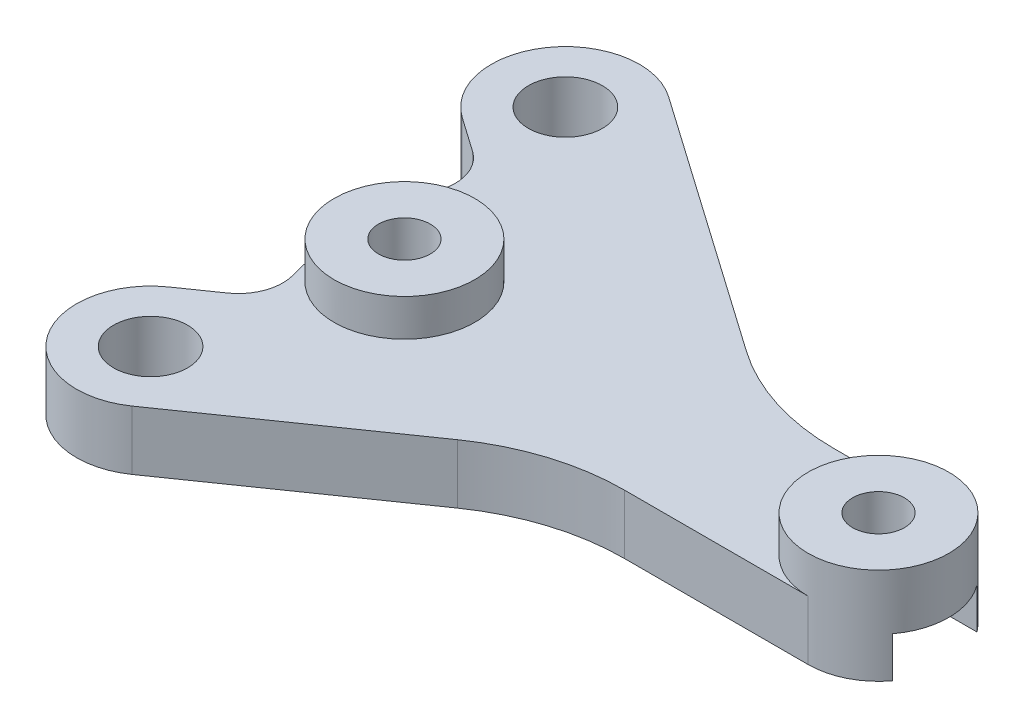
ISO-10303-21;
HEADER;
FILE_DESCRIPTION(('STEP AP214'),'2;1');
FILE_NAME('part.step','',(''),(''),'','','');
FILE_SCHEMA(('AUTOMOTIVE_DESIGN { 1 0 10303 214 1 1 1 1 }'));
ENDSEC;
DATA;
#1=APPLICATION_CONTEXT('core data for automotive mechanical design processes');
#2=APPLICATION_PROTOCOL_DEFINITION('international standard','automotive_design',2000,#1);
#3=PRODUCT_CONTEXT('',#1,'mechanical');
#4=PRODUCT('Part','Part','',(#3));
#5=PRODUCT_RELATED_PRODUCT_CATEGORY('part','',(#4));
#6=PRODUCT_DEFINITION_FORMATION('','',#4);
#7=PRODUCT_DEFINITION_CONTEXT('part definition',#1,'design');
#8=PRODUCT_DEFINITION('design','',#6,#7);
#9=PRODUCT_DEFINITION_SHAPE('','',#8);
#10=(LENGTH_UNIT() NAMED_UNIT(*) SI_UNIT(.MILLI.,.METRE.));
#11=(NAMED_UNIT(*) PLANE_ANGLE_UNIT() SI_UNIT($,.RADIAN.));
#12=(NAMED_UNIT(*) SI_UNIT($,.STERADIAN.) SOLID_ANGLE_UNIT());
#13=UNCERTAINTY_MEASURE_WITH_UNIT(LENGTH_MEASURE(1.E-05),#10,'distance_accuracy_value','');
#14=(GEOMETRIC_REPRESENTATION_CONTEXT(3) GLOBAL_UNCERTAINTY_ASSIGNED_CONTEXT((#13)) GLOBAL_UNIT_ASSIGNED_CONTEXT((#10,
#11,#12)) REPRESENTATION_CONTEXT('',''));
#15=CARTESIAN_POINT('',(0.,0.,0.));
#16=DIRECTION('',(0.,0.,1.));
#17=DIRECTION('',(1.,0.,0.));
#18=AXIS2_PLACEMENT_3D('',#15,#16,#17);
#19=CARTESIAN_POINT('',(0.,0.,0.));
#20=DIRECTION('',(0.,1.,0.));
#21=DIRECTION('',(0.,0.,1.));
#22=AXIS2_PLACEMENT_3D('',#19,#20,#21);
#23=PLANE('',#22);
#24=CARTESIAN_POINT('',(5.90778746838002,0.,-0.233987523106802));
#25=DIRECTION('',(0.,-1.,0.));
#26=DIRECTION('',(0.,0.,-1.));
#27=AXIS2_PLACEMENT_3D('',#24,#25,#26);
#28=CIRCLE('',#27,9.);
#29=CARTESIAN_POINT('',(-2.6290444966993,0.,2.6160124768932));
#30=VERTEX_POINT('',#29);
#31=CARTESIAN_POINT('',(-2.6290444966993,0.,-3.0839875231068));
#32=VERTEX_POINT('',#31);
#33=EDGE_CURVE('E542',#30,#32,#28,.T.);
#34=ORIENTED_EDGE('',*,*,#33,.F.);
#35=DIRECTION('',(-1.,0.,0.));
#36=VECTOR('',#35,1.);
#37=CARTESIAN_POINT('',(0.,0.,2.6160124768932));
#38=LINE('',#37,#36);
#39=CARTESIAN_POINT('',(9.70778746838002,0.,2.6160124768932));
#40=VERTEX_POINT('',#39);
#41=EDGE_CURVE('E519',#40,#30,#38,.T.);
#42=ORIENTED_EDGE('',*,*,#41,.F.);
#43=CARTESIAN_POINT('',(5.90778746838002,0.,-0.233987523106802));
#44=DIRECTION('',(0.,1.,0.));
#45=DIRECTION('',(0.,0.,1.));
#46=AXIS2_PLACEMENT_3D('',#43,#44,#45);
#47=CIRCLE('',#46,4.75);
#48=CARTESIAN_POINT('',(5.90778746838002,0.,4.5160124768932));
#49=VERTEX_POINT('',#48);
#50=EDGE_CURVE('E638',#49,#40,#47,.T.);
#51=ORIENTED_EDGE('',*,*,#50,.F.);
#52=DIRECTION('',(-1.,0.,0.));
#53=VECTOR('',#52,1.);
#54=CARTESIAN_POINT('',(0.,0.,4.5160124768932));
#55=LINE('',#54,#53);
#56=CARTESIAN_POINT('',(-6.50128457022286,0.,4.5160124768932));
#57=VERTEX_POINT('',#56);
#58=EDGE_CURVE('E634',#49,#57,#55,.T.);
#59=ORIENTED_EDGE('',*,*,#58,.T.);
#60=CARTESIAN_POINT('',(-6.50128457022285,0.,19.5160124768932));
#61=DIRECTION('',(0.,1.,0.));
#62=DIRECTION('',(0.,0.,1.));
#63=AXIS2_PLACEMENT_3D('',#60,#61,#62);
#64=CIRCLE('',#63,15.);
#65=CARTESIAN_POINT('',(-15.0719802077242,0.,7.20572505988642));
#66=VERTEX_POINT('',#65);
#67=EDGE_CURVE('E368',#57,#66,#64,.T.);
#68=ORIENTED_EDGE('',*,*,#67,.T.);
#69=DIRECTION('',(0.820685827800452,0.,-0.571379709166757));
#70=VECTOR('',#69,1.);
#71=CARTESIAN_POINT('',(-1.54168943588688,0.,-2.21436402203912));
#72=LINE('',#71,#70);
#73=CARTESIAN_POINT('',(-28.0195598346601,0.,16.2201176947387));
#74=VERTEX_POINT('',#73);
#75=EDGE_CURVE('E599',#74,#66,#72,.T.);
#76=ORIENTED_EDGE('',*,*,#75,.F.);
#77=CARTESIAN_POINT('',(-30.8764583804938,0.,12.1166885557364));
#78=DIRECTION('',(0.,1.,0.));
#79=DIRECTION('',(0.,0.,1.));
#80=AXIS2_PLACEMENT_3D('',#77,#78,#79);
#81=CIRCLE('',#80,5.);
#82=CARTESIAN_POINT('',(-33.7333569263276,0.,8.01325941673418));
#83=VERTEX_POINT('',#82);
#84=EDGE_CURVE('E660',#83,#74,#81,.T.);
#85=ORIENTED_EDGE('',*,*,#84,.F.);
#86=DIRECTION('',(0.820685827800452,0.,-0.571379709166756));
#87=VECTOR('',#86,1.);
#88=CARTESIAN_POINT('',(-7.25548652755441,0.,-10.4212223000436));
#89=LINE('',#88,#87);
#90=CARTESIAN_POINT('',(-31.4165898033694,0.,6.40027466656397));
#91=VERTEX_POINT('',#90);
#92=EDGE_CURVE('E657',#83,#91,#89,.T.);
#93=ORIENTED_EDGE('',*,*,#92,.T.);
#94=CARTESIAN_POINT('',(-33.1307289308697,0.,3.93821718316261));
#95=DIRECTION('',(0.,1.,0.));
#96=DIRECTION('',(0.,0.,1.));
#97=AXIS2_PLACEMENT_3D('',#94,#95,#96);
#98=CIRCLE('',#97,3.);
#99=CARTESIAN_POINT('',(-30.2453797509483,0.,3.11677935232746));
#100=VERTEX_POINT('',#99);
#101=EDGE_CURVE('E692',#91,#100,#98,.T.);
#102=ORIENTED_EDGE('',*,*,#101,.T.);
#103=CARTESIAN_POINT('',(-12.6822637877984,0.,-1.88331144426357));
#104=DIRECTION('',(0.,1.,0.));
#105=DIRECTION('',(0.,0.,1.));
#106=AXIS2_PLACEMENT_3D('',#103,#104,#105);
#107=CIRCLE('',#106,18.2609953263563);
#108=CARTESIAN_POINT('',(-30.3802872526295,0.,2.61601247689319));
#109=VERTEX_POINT('',#108);
#110=EDGE_CURVE('E653',#109,#100,#107,.T.);
#111=ORIENTED_EDGE('',*,*,#110,.F.);
#112=DIRECTION('',(-1.,0.,0.));
#113=VECTOR('',#112,1.);
#114=CARTESIAN_POINT('',(0.,0.,2.6160124768932));
#115=LINE('',#114,#113);
#116=CARTESIAN_POINT('',(-17.5553805665407,0.,2.6160124768932));
#117=VERTEX_POINT('',#116);
#118=EDGE_CURVE('E558',#117,#109,#115,.T.);
#119=ORIENTED_EDGE('',*,*,#118,.F.);
#120=CARTESIAN_POINT('',(-26.09221253162,0.,-0.233987523106804));
#121=DIRECTION('',(0.,-1.,0.));
#122=DIRECTION('',(0.,0.,-1.));
#123=AXIS2_PLACEMENT_3D('',#120,#121,#122);
#124=CIRCLE('',#123,9.);
#125=CARTESIAN_POINT('',(-17.5553805665407,0.,-3.08398752310681));
#126=VERTEX_POINT('',#125);
#127=EDGE_CURVE('E569',#126,#117,#124,.T.);
#128=ORIENTED_EDGE('',*,*,#127,.F.);
#129=DIRECTION('',(-1.,0.,0.));
#130=VECTOR('',#129,1.);
#131=CARTESIAN_POINT('',(0.,0.,-3.0839875231068));
#132=LINE('',#131,#130);
#133=CARTESIAN_POINT('',(-30.9037436196589,0.,-3.08398752310681));
#134=VERTEX_POINT('',#133);
#135=EDGE_CURVE('E566',#126,#134,#132,.T.);
#136=ORIENTED_EDGE('',*,*,#135,.T.);
#137=CARTESIAN_POINT('',(-30.2471696464017,0.,-6.8771108482854));
#138=VERTEX_POINT('',#137);
#139=EDGE_CURVE('E654',#138,#134,#107,.T.);
#140=ORIENTED_EDGE('',*,*,#139,.F.);
#141=CARTESIAN_POINT('',(-33.132812878551,0.,-7.69751510031665));
#142=DIRECTION('',(0.,1.,0.));
#143=DIRECTION('',(0.,0.,1.));
#144=AXIS2_PLACEMENT_3D('',#141,#142,#143);
#145=CIRCLE('',#144,3.);
#146=CARTESIAN_POINT('',(-31.4124258454611,0.,-10.1552108618738));
#147=VERTEX_POINT('',#146);
#148=EDGE_CURVE('E697',#138,#147,#145,.T.);
#149=ORIENTED_EDGE('',*,*,#148,.T.);
#150=DIRECTION('',(0.819231920519041,0.,0.573462344363328));
#151=VECTOR('',#150,1.);
#152=CARTESIAN_POINT('',(-5.55935641675453,0.,7.94193773822077));
#153=LINE('',#152,#151);
#154=CARTESIAN_POINT('',(-33.7437701023105,0.,-11.7871518416684));
#155=VERTEX_POINT('',#154);
#156=EDGE_CURVE('E650',#155,#147,#153,.T.);
#157=ORIENTED_EDGE('',*,*,#156,.F.);
#158=CARTESIAN_POINT('',(-30.8764583804938,0.,-15.8833114442636));
#159=DIRECTION('',(0.,1.,0.));
#160=DIRECTION('',(0.,0.,1.));
#161=AXIS2_PLACEMENT_3D('',#158,#159,#160);
#162=CIRCLE('',#161,4.99999999999999);
#163=CARTESIAN_POINT('',(-28.0091466586772,0.,-19.9794710468588));
#164=VERTEX_POINT('',#163);
#165=EDGE_CURVE('E647',#164,#155,#162,.T.);
#166=ORIENTED_EDGE('',*,*,#165,.F.);
#167=DIRECTION('',(0.81923192051904,0.,0.573462344363328));
#168=VECTOR('',#167,1.);
#169=CARTESIAN_POINT('',(0.175267026878727,0.,-0.250381466969609));
#170=LINE('',#169,#168);
#171=CARTESIAN_POINT('',(-10.460629042195,0.,-7.6955087153212));
#172=VERTEX_POINT('',#171);
#173=EDGE_CURVE('E644',#164,#172,#170,.T.);
#174=ORIENTED_EDGE('',*,*,#173,.T.);
#175=CARTESIAN_POINT('',(-1.85869387674504,0.,-19.9839875231068));
#176=DIRECTION('',(0.,1.,0.));
#177=DIRECTION('',(0.,0.,1.));
#178=AXIS2_PLACEMENT_3D('',#175,#176,#177);
#179=CIRCLE('',#178,15.);
#180=CARTESIAN_POINT('',(-1.85869387674504,0.,-4.9839875231068));
#181=VERTEX_POINT('',#180);
#182=EDGE_CURVE('E711',#172,#181,#179,.T.);
#183=ORIENTED_EDGE('',*,*,#182,.T.);
#184=DIRECTION('',(1.,0.,0.));
#185=VECTOR('',#184,1.);
#186=CARTESIAN_POINT('',(0.,0.,-4.9839875231068));
#187=LINE('',#186,#185);
#188=CARTESIAN_POINT('',(5.90778746838002,0.,-4.9839875231068));
#189=VERTEX_POINT('',#188);
#190=EDGE_CURVE('E641',#181,#189,#187,.T.);
#191=ORIENTED_EDGE('',*,*,#190,.T.);
#192=CARTESIAN_POINT('',(9.70778746838002,0.,-3.0839875231068));
#193=VERTEX_POINT('',#192);
#194=EDGE_CURVE('E637',#193,#189,#47,.T.);
#195=ORIENTED_EDGE('',*,*,#194,.F.);
#196=DIRECTION('',(-1.,0.,0.));
#197=VECTOR('',#196,1.);
#198=CARTESIAN_POINT('',(0.,0.,-3.0839875231068));
#199=LINE('',#198,#197);
#200=EDGE_CURVE('E536',#193,#32,#199,.T.);
#201=ORIENTED_EDGE('',*,*,#200,.T.);
#202=EDGE_LOOP('',(#34,#42,#51,#59,#68,#76,#85,#93,#102,#111,#119,#128,#136,#140,#149,#157,#166,
#174,#183,#191,#195,#201));
#203=FACE_BOUND('',#202,.T.);
#204=CARTESIAN_POINT('',(-30.8764583804938,0.,12.1166885557364));
#205=DIRECTION('',(0.,1.,0.));
#206=DIRECTION('',(0.,0.,1.));
#207=AXIS2_PLACEMENT_3D('',#204,#205,#206);
#208=CIRCLE('',#207,2.5);
#209=CARTESIAN_POINT('',(-30.8764583804938,0.,14.6166885557364));
#210=VERTEX_POINT('',#209);
#211=EDGE_CURVE('E631',#210,#210,#208,.T.);
#212=ORIENTED_EDGE('',*,*,#211,.T.);
#213=EDGE_LOOP('',(#212));
#214=FACE_BOUND('',#213,.T.);
#215=CARTESIAN_POINT('',(-30.8764583804938,0.,-15.8833114442636));
#216=DIRECTION('',(0.,1.,0.));
#217=DIRECTION('',(0.,0.,1.));
#218=AXIS2_PLACEMENT_3D('',#215,#216,#217);
#219=CIRCLE('',#218,2.5);
#220=CARTESIAN_POINT('',(-30.8764583804938,0.,-13.3833114442636));
#221=VERTEX_POINT('',#220);
#222=EDGE_CURVE('E592',#221,#221,#219,.T.);
#223=ORIENTED_EDGE('',*,*,#222,.T.);
#224=EDGE_LOOP('',(#223));
#225=FACE_BOUND('',#224,.T.);
#226=ADVANCED_FACE('F360',(#203,#214,#225),#23,.F.);
#227=CARTESIAN_POINT('',(5.90778746838002,4.,-0.233987523106802));
#228=DIRECTION('',(0.,-1.,0.));
#229=DIRECTION('',(0.,0.,-1.));
#230=AXIS2_PLACEMENT_3D('',#227,#228,#229);
#231=CYLINDRICAL_SURFACE('',#230,1.75);
#232=CARTESIAN_POINT('',(5.90778746838002,6.5,-0.233987523106802));
#233=DIRECTION('',(0.,1.,0.));
#234=DIRECTION('',(0.,0.,1.));
#235=AXIS2_PLACEMENT_3D('',#232,#233,#234);
#236=CIRCLE('',#235,1.75);
#237=CARTESIAN_POINT('',(5.90778746838002,6.5,1.5160124768932));
#238=VERTEX_POINT('',#237);
#239=EDGE_CURVE('E549',#238,#238,#236,.T.);
#240=ORIENTED_EDGE('',*,*,#239,.T.);
#241=EDGE_LOOP('',(#240));
#242=FACE_BOUND('',#241,.T.);
#243=CARTESIAN_POINT('',(5.90778746838002,2.75,-0.233987523106802));
#244=DIRECTION('',(0.,-1.,0.));
#245=DIRECTION('',(0.,0.,-1.));
#246=AXIS2_PLACEMENT_3D('',#243,#244,#245);
#247=CIRCLE('',#246,1.75);
#248=CARTESIAN_POINT('',(5.90778746838002,2.75,-1.9839875231068));
#249=VERTEX_POINT('',#248);
#250=EDGE_CURVE('E533',#249,#249,#247,.F.);
#251=ORIENTED_EDGE('',*,*,#250,.F.);
#252=EDGE_LOOP('',(#251));
#253=FACE_BOUND('',#252,.T.);
#254=ADVANCED_FACE('F807',(#242,#253),#231,.F.);
#255=CARTESIAN_POINT('',(-26.09221253162,4.,-0.233987523106804));
#256=DIRECTION('',(0.,-1.,0.));
#257=DIRECTION('',(0.,0.,-1.));
#258=AXIS2_PLACEMENT_3D('',#255,#256,#257);
#259=CYLINDRICAL_SURFACE('',#258,1.75);
#260=CARTESIAN_POINT('',(-26.09221253162,6.5,-0.233987523106804));
#261=DIRECTION('',(0.,1.,0.));
#262=DIRECTION('',(0.,0.,1.));
#263=AXIS2_PLACEMENT_3D('',#260,#261,#262);
#264=CIRCLE('',#263,1.75);
#265=CARTESIAN_POINT('',(-26.09221253162,6.5,1.5160124768932));
#266=VERTEX_POINT('',#265);
#267=EDGE_CURVE('E585',#266,#266,#264,.T.);
#268=ORIENTED_EDGE('',*,*,#267,.T.);
#269=EDGE_LOOP('',(#268));
#270=FACE_BOUND('',#269,.T.);
#271=CARTESIAN_POINT('',(-26.09221253162,2.75,-0.233987523106804));
#272=DIRECTION('',(0.,-1.,0.));
#273=DIRECTION('',(0.,0.,-1.));
#274=AXIS2_PLACEMENT_3D('',#271,#272,#273);
#275=CIRCLE('',#274,1.75);
#276=CARTESIAN_POINT('',(-26.09221253162,2.75,-1.9839875231068));
#277=VERTEX_POINT('',#276);
#278=EDGE_CURVE('E554',#277,#277,#275,.F.);
#279=ORIENTED_EDGE('',*,*,#278,.F.);
#280=EDGE_LOOP('',(#279));
#281=FACE_BOUND('',#280,.T.);
#282=ADVANCED_FACE('F812',(#270,#281),#259,.F.);
#283=CARTESIAN_POINT('',(-12.6822637877984,4.,-1.88331144426357));
#284=DIRECTION('',(0.,-1.,0.));
#285=DIRECTION('',(0.,0.,-1.));
#286=AXIS2_PLACEMENT_3D('',#283,#284,#285);
#287=CYLINDRICAL_SURFACE('',#286,18.2609953263563);
#288=DIRECTION('',(0.,-1.,0.));
#289=VECTOR('',#288,1.);
#290=CARTESIAN_POINT('',(-30.9037436196589,2.75,-3.08398752310681));
#291=LINE('',#290,#289);
#292=CARTESIAN_POINT('',(-30.9037436196589,2.75,-3.08398752310681));
#293=VERTEX_POINT('',#292);
#294=EDGE_CURVE('E543',#293,#134,#291,.T.);
#295=ORIENTED_EDGE('',*,*,#294,.F.);
#296=CARTESIAN_POINT('',(-12.6822637877984,2.75,-1.88331144426357));
#297=DIRECTION('',(0.,-1.,0.));
#298=DIRECTION('',(0.,0.,-1.));
#299=AXIS2_PLACEMENT_3D('',#296,#297,#298);
#300=CIRCLE('',#299,18.2609953263563);
#301=CARTESIAN_POINT('',(-30.3802872526295,2.75,2.61601247689319));
#302=VERTEX_POINT('',#301);
#303=EDGE_CURVE('E563',#302,#293,#300,.T.);
#304=ORIENTED_EDGE('',*,*,#303,.F.);
#305=DIRECTION('',(0.,-1.,0.));
#306=VECTOR('',#305,1.);
#307=CARTESIAN_POINT('',(-30.3802872526295,2.75,2.61601247689319));
#308=LINE('',#307,#306);
#309=EDGE_CURVE('E574',#302,#109,#308,.T.);
#310=ORIENTED_EDGE('',*,*,#309,.T.);
#311=ORIENTED_EDGE('',*,*,#110,.T.);
#312=DIRECTION('',(0.,-1.,0.));
#313=VECTOR('',#312,1.);
#314=CARTESIAN_POINT('',(-30.2453797509484,4.,3.11677935232746));
#315=LINE('',#314,#313);
#316=CARTESIAN_POINT('',(-30.2453797509483,4.,3.11677935232746));
#317=VERTEX_POINT('',#316);
#318=EDGE_CURVE('E688',#100,#317,#315,.F.);
#319=ORIENTED_EDGE('',*,*,#318,.T.);
#320=CARTESIAN_POINT('',(-12.6822637877984,4.,-1.88331144426357));
#321=DIRECTION('',(0.,1.,0.));
#322=DIRECTION('',(0.,0.,1.));
#323=AXIS2_PLACEMENT_3D('',#320,#321,#322);
#324=CIRCLE('',#323,18.2609953263563);
#325=CARTESIAN_POINT('',(-30.8066880380171,4.,0.345857886965393));
#326=VERTEX_POINT('',#325);
#327=EDGE_CURVE('E616',#326,#317,#324,.T.);
#328=ORIENTED_EDGE('',*,*,#327,.F.);
#329=CARTESIAN_POINT('',(-30.2471696464017,4.,-6.8771108482854));
#330=VERTEX_POINT('',#329);
#331=EDGE_CURVE('E617',#330,#326,#324,.T.);
#332=ORIENTED_EDGE('',*,*,#331,.F.);
#333=DIRECTION('',(0.,-1.,0.));
#334=VECTOR('',#333,1.);
#335=CARTESIAN_POINT('',(-30.2471696464017,4.,-6.8771108482854));
#336=LINE('',#335,#334);
#337=EDGE_CURVE('E685',#330,#138,#336,.T.);
#338=ORIENTED_EDGE('',*,*,#337,.T.);
#339=ORIENTED_EDGE('',*,*,#139,.T.);
#340=EDGE_LOOP('',(#295,#304,#310,#311,#319,#328,#332,#338,#339));
#341=FACE_BOUND('',#340,.T.);
#342=ADVANCED_FACE('F767',(#341),#287,.T.);
#343=CARTESIAN_POINT('',(0.,4.,0.));
#344=DIRECTION('',(0.,1.,0.));
#345=DIRECTION('',(0.,0.,1.));
#346=AXIS2_PLACEMENT_3D('',#343,#344,#345);
#347=PLANE('',#346);
#348=CARTESIAN_POINT('',(-30.8764583804938,4.,12.1166885557364));
#349=DIRECTION('',(0.,1.,0.));
#350=DIRECTION('',(0.,0.,1.));
#351=AXIS2_PLACEMENT_3D('',#348,#349,#350);
#352=CIRCLE('',#351,2.5);
#353=CARTESIAN_POINT('',(-30.8764583804938,4.,14.6166885557364));
#354=VERTEX_POINT('',#353);
#355=EDGE_CURVE('E598',#354,#354,#352,.T.);
#356=ORIENTED_EDGE('',*,*,#355,.F.);
#357=EDGE_LOOP('',(#356));
#358=FACE_BOUND('',#357,.T.);
#359=CARTESIAN_POINT('',(-30.8764583804938,4.,-15.8833114442636));
#360=DIRECTION('',(0.,1.,0.));
#361=DIRECTION('',(0.,0.,1.));
#362=AXIS2_PLACEMENT_3D('',#359,#360,#361);
#363=CIRCLE('',#362,2.5);
#364=CARTESIAN_POINT('',(-30.8764583804938,4.,-13.3833114442636));
#365=VERTEX_POINT('',#364);
#366=EDGE_CURVE('E595',#365,#365,#363,.T.);
#367=ORIENTED_EDGE('',*,*,#366,.F.);
#368=EDGE_LOOP('',(#367));
#369=FACE_BOUND('',#368,.T.);
#370=DIRECTION('',(-1.,0.,0.));
#371=VECTOR('',#370,1.);
#372=CARTESIAN_POINT('',(0.,4.,4.5160124768932));
#373=LINE('',#372,#371);
#374=CARTESIAN_POINT('',(5.90778746838002,4.,4.5160124768932));
#375=VERTEX_POINT('',#374);
#376=CARTESIAN_POINT('',(-6.50128457022286,4.,4.5160124768932));
#377=VERTEX_POINT('',#376);
#378=EDGE_CURVE('E602',#375,#377,#373,.T.);
#379=ORIENTED_EDGE('',*,*,#378,.F.);
#380=CARTESIAN_POINT('',(5.90778746838002,4.,-0.233987523106802));
#381=DIRECTION('',(0.,1.,0.));
#382=DIRECTION('',(0.,0.,1.));
#383=AXIS2_PLACEMENT_3D('',#380,#381,#382);
#384=CIRCLE('',#383,4.75);
#385=CARTESIAN_POINT('',(5.90778746838002,4.,-4.9839875231068));
#386=VERTEX_POINT('',#385);
#387=EDGE_CURVE('E679',#375,#386,#384,.F.);
#388=ORIENTED_EDGE('',*,*,#387,.T.);
#389=DIRECTION('',(1.,0.,0.));
#390=VECTOR('',#389,1.);
#391=CARTESIAN_POINT('',(0.,4.,-4.9839875231068));
#392=LINE('',#391,#390);
#393=CARTESIAN_POINT('',(-1.85869387674504,4.,-4.9839875231068));
#394=VERTEX_POINT('',#393);
#395=EDGE_CURVE('E605',#394,#386,#392,.T.);
#396=ORIENTED_EDGE('',*,*,#395,.F.);
#397=CARTESIAN_POINT('',(-1.85869387674504,4.,-19.9839875231068));
#398=DIRECTION('',(0.,1.,0.));
#399=DIRECTION('',(0.,0.,1.));
#400=AXIS2_PLACEMENT_3D('',#397,#398,#399);
#401=CIRCLE('',#400,15.);
#402=CARTESIAN_POINT('',(-10.460629042195,4.,-7.6955087153212));
#403=VERTEX_POINT('',#402);
#404=EDGE_CURVE('E713',#394,#403,#401,.F.);
#405=ORIENTED_EDGE('',*,*,#404,.T.);
#406=DIRECTION('',(0.81923192051904,0.,0.573462344363328));
#407=VECTOR('',#406,1.);
#408=CARTESIAN_POINT('',(0.175267026878727,4.,-0.250381466969609));
#409=LINE('',#408,#407);
#410=CARTESIAN_POINT('',(-28.0091466586772,4.,-19.9794710468588));
#411=VERTEX_POINT('',#410);
#412=EDGE_CURVE('E607',#411,#403,#409,.T.);
#413=ORIENTED_EDGE('',*,*,#412,.F.);
#414=CARTESIAN_POINT('',(-30.8764583804938,4.,-15.8833114442636));
#415=DIRECTION('',(0.,1.,0.));
#416=DIRECTION('',(0.,0.,1.));
#417=AXIS2_PLACEMENT_3D('',#414,#415,#416);
#418=CIRCLE('',#417,4.99999999999999);
#419=CARTESIAN_POINT('',(-33.7437701023105,4.,-11.7871518416684));
#420=VERTEX_POINT('',#419);
#421=EDGE_CURVE('E610',#411,#420,#418,.T.);
#422=ORIENTED_EDGE('',*,*,#421,.T.);
#423=DIRECTION('',(0.819231920519041,0.,0.573462344363328));
#424=VECTOR('',#423,1.);
#425=CARTESIAN_POINT('',(-5.55935641675453,4.,7.94193773822077));
#426=LINE('',#425,#424);
#427=CARTESIAN_POINT('',(-31.4124258454611,4.,-10.1552108618738));
#428=VERTEX_POINT('',#427);
#429=EDGE_CURVE('E613',#420,#428,#426,.T.);
#430=ORIENTED_EDGE('',*,*,#429,.T.);
#431=CARTESIAN_POINT('',(-33.132812878551,4.,-7.69751510031665));
#432=DIRECTION('',(0.,1.,0.));
#433=DIRECTION('',(0.,0.,1.));
#434=AXIS2_PLACEMENT_3D('',#431,#432,#433);
#435=CIRCLE('',#434,3.);
#436=EDGE_CURVE('E699',#428,#330,#435,.F.);
#437=ORIENTED_EDGE('',*,*,#436,.T.);
#438=ORIENTED_EDGE('',*,*,#331,.T.);
#439=CARTESIAN_POINT('',(-26.09221253162,4.,-0.233987523106804));
#440=DIRECTION('',(0.,1.,0.));
#441=DIRECTION('',(0.,0.,1.));
#442=AXIS2_PLACEMENT_3D('',#439,#440,#441);
#443=CIRCLE('',#442,4.75);
#444=EDGE_CURVE('E588',#326,#326,#443,.T.);
#445=ORIENTED_EDGE('',*,*,#444,.F.);
#446=ORIENTED_EDGE('',*,*,#327,.T.);
#447=CARTESIAN_POINT('',(-33.1307289308697,4.,3.93821718316261));
#448=DIRECTION('',(0.,1.,0.));
#449=DIRECTION('',(0.,0.,1.));
#450=AXIS2_PLACEMENT_3D('',#447,#448,#449);
#451=CIRCLE('',#450,3.);
#452=CARTESIAN_POINT('',(-31.4165898033694,4.,6.40027466656397));
#453=VERTEX_POINT('',#452);
#454=EDGE_CURVE('E695',#317,#453,#451,.F.);
#455=ORIENTED_EDGE('',*,*,#454,.T.);
#456=DIRECTION('',(0.820685827800452,0.,-0.571379709166756));
#457=VECTOR('',#456,1.);
#458=CARTESIAN_POINT('',(-7.25548652755441,4.,-10.4212223000436));
#459=LINE('',#458,#457);
#460=CARTESIAN_POINT('',(-33.7333569263276,4.,8.01325941673418));
#461=VERTEX_POINT('',#460);
#462=EDGE_CURVE('E619',#461,#453,#459,.T.);
#463=ORIENTED_EDGE('',*,*,#462,.F.);
#464=CARTESIAN_POINT('',(-30.8764583804938,4.,12.1166885557364));
#465=DIRECTION('',(0.,1.,0.));
#466=DIRECTION('',(0.,0.,1.));
#467=AXIS2_PLACEMENT_3D('',#464,#465,#466);
#468=CIRCLE('',#467,5.);
#469=CARTESIAN_POINT('',(-28.0195598346601,4.,16.2201176947387));
#470=VERTEX_POINT('',#469);
#471=EDGE_CURVE('E622',#461,#470,#468,.T.);
#472=ORIENTED_EDGE('',*,*,#471,.T.);
#473=DIRECTION('',(0.820685827800452,0.,-0.571379709166757));
#474=VECTOR('',#473,1.);
#475=CARTESIAN_POINT('',(-1.54168943588688,4.,-2.21436402203912));
#476=LINE('',#475,#474);
#477=CARTESIAN_POINT('',(-15.0719802077242,4.,7.20572505988642));
#478=VERTEX_POINT('',#477);
#479=EDGE_CURVE('E625',#470,#478,#476,.T.);
#480=ORIENTED_EDGE('',*,*,#479,.T.);
#481=CARTESIAN_POINT('',(-6.50128457022285,4.,19.5160124768932));
#482=DIRECTION('',(0.,1.,0.));
#483=DIRECTION('',(0.,0.,1.));
#484=AXIS2_PLACEMENT_3D('',#481,#482,#483);
#485=CIRCLE('',#484,15.);
#486=EDGE_CURVE('E12',#478,#377,#485,.F.);
#487=ORIENTED_EDGE('',*,*,#486,.T.);
#488=EDGE_LOOP('',(#379,#388,#396,#405,#413,#422,#430,#437,#438,#445,#446,#455,#463,#472,#480,#487));
#489=FACE_BOUND('',#488,.T.);
#490=ADVANCED_FACE('F728',(#358,#369,#489),#347,.T.);
#491=CARTESIAN_POINT('',(-30.8764583804938,4.,-15.8833114442636));
#492=DIRECTION('',(0.,-1.,0.));
#493=DIRECTION('',(0.,0.,-1.));
#494=AXIS2_PLACEMENT_3D('',#491,#492,#493);
#495=CYLINDRICAL_SURFACE('',#494,2.5);
#496=ORIENTED_EDGE('',*,*,#366,.T.);
#497=EDGE_LOOP('',(#496));
#498=FACE_BOUND('',#497,.T.);
#499=ORIENTED_EDGE('',*,*,#222,.F.);
#500=EDGE_LOOP('',(#499));
#501=FACE_BOUND('',#500,.T.);
#502=ADVANCED_FACE('F818',(#498,#501),#495,.F.);
#503=CARTESIAN_POINT('',(-30.8764583804938,4.,12.1166885557364));
#504=DIRECTION('',(0.,-1.,0.));
#505=DIRECTION('',(0.,0.,-1.));
#506=AXIS2_PLACEMENT_3D('',#503,#504,#505);
#507=CYLINDRICAL_SURFACE('',#506,2.5);
#508=ORIENTED_EDGE('',*,*,#355,.T.);
#509=EDGE_LOOP('',(#508));
#510=FACE_BOUND('',#509,.T.);
#511=ORIENTED_EDGE('',*,*,#211,.F.);
#512=EDGE_LOOP('',(#511));
#513=FACE_BOUND('',#512,.T.);
#514=ADVANCED_FACE('F1040',(#510,#513),#507,.F.);
#515=CARTESIAN_POINT('',(-30.8764583804938,4.,-15.8833114442636));
#516=DIRECTION('',(0.,-1.,0.));
#517=DIRECTION('',(0.,0.,-1.));
#518=AXIS2_PLACEMENT_3D('',#515,#516,#517);
#519=CYLINDRICAL_SURFACE('',#518,4.99999999999999);
#520=ORIENTED_EDGE('',*,*,#165,.T.);
#521=DIRECTION('',(0.,-1.,0.));
#522=VECTOR('',#521,1.);
#523=CARTESIAN_POINT('',(-33.7437701023105,4.,-11.7871518416684));
#524=LINE('',#523,#522);
#525=EDGE_CURVE('E669',#420,#155,#524,.T.);
#526=ORIENTED_EDGE('',*,*,#525,.F.);
#527=ORIENTED_EDGE('',*,*,#421,.F.);
#528=DIRECTION('',(0.,-1.,0.));
#529=VECTOR('',#528,1.);
#530=CARTESIAN_POINT('',(-28.0091466586772,4.,-19.9794710468588));
#531=LINE('',#530,#529);
#532=EDGE_CURVE('E672',#411,#164,#531,.T.);
#533=ORIENTED_EDGE('',*,*,#532,.T.);
#534=EDGE_LOOP('',(#520,#526,#527,#533));
#535=FACE_BOUND('',#534,.T.);
#536=ADVANCED_FACE('F755',(#535),#519,.T.);
#537=CARTESIAN_POINT('',(0.175267026878727,4.,-0.250381466969609));
#538=DIRECTION('',(0.573462344363329,0.,-0.81923192051904));
#539=DIRECTION('',(-0.81923192051904,0.,-0.573462344363329));
#540=AXIS2_PLACEMENT_3D('',#537,#538,#539);
#541=PLANE('',#540);
#542=ORIENTED_EDGE('',*,*,#412,.T.);
#543=DIRECTION('',(0.,-1.,0.));
#544=VECTOR('',#543,1.);
#545=CARTESIAN_POINT('',(-10.460629042195,0.,-7.69550871532119));
#546=LINE('',#545,#544);
#547=EDGE_CURVE('E701',#403,#172,#546,.T.);
#548=ORIENTED_EDGE('',*,*,#547,.T.);
#549=ORIENTED_EDGE('',*,*,#173,.F.);
#550=ORIENTED_EDGE('',*,*,#532,.F.);
#551=EDGE_LOOP('',(#542,#548,#549,#550));
#552=FACE_BOUND('',#551,.T.);
#553=ADVANCED_FACE('F751',(#552),#541,.T.);
#554=CARTESIAN_POINT('',(0.,4.,-4.9839875231068));
#555=DIRECTION('',(0.,0.,-1.));
#556=DIRECTION('',(-1.,0.,0.));
#557=AXIS2_PLACEMENT_3D('',#554,#555,#556);
#558=PLANE('',#557);
#559=ORIENTED_EDGE('',*,*,#190,.F.);
#560=DIRECTION('',(0.,-1.,0.));
#561=VECTOR('',#560,1.);
#562=CARTESIAN_POINT('',(-1.85869387674504,4.,-4.9839875231068));
#563=LINE('',#562,#561);
#564=EDGE_CURVE('E704',#181,#394,#563,.F.);
#565=ORIENTED_EDGE('',*,*,#564,.T.);
#566=ORIENTED_EDGE('',*,*,#395,.T.);
#567=DIRECTION('',(0.,-1.,0.));
#568=VECTOR('',#567,1.);
#569=CARTESIAN_POINT('',(5.90778746838002,4.,-4.9839875231068));
#570=LINE('',#569,#568);
#571=EDGE_CURVE('E674',#386,#189,#570,.T.);
#572=ORIENTED_EDGE('',*,*,#571,.T.);
#573=EDGE_LOOP('',(#559,#565,#566,#572));
#574=FACE_BOUND('',#573,.T.);
#575=ADVANCED_FACE('F742',(#574),#558,.T.);
#576=CARTESIAN_POINT('',(5.90778746838002,4.,-0.233987523106802));
#577=DIRECTION('',(0.,-1.,0.));
#578=DIRECTION('',(0.,0.,-1.));
#579=AXIS2_PLACEMENT_3D('',#576,#577,#578);
#580=CYLINDRICAL_SURFACE('',#579,4.75);
#581=ORIENTED_EDGE('',*,*,#50,.T.);
#582=DIRECTION('',(0.,-1.,0.));
#583=VECTOR('',#582,1.);
#584=CARTESIAN_POINT('',(9.70778746838002,2.75,2.6160124768932));
#585=LINE('',#584,#583);
#586=CARTESIAN_POINT('',(9.70778746838002,2.75,2.6160124768932));
#587=VERTEX_POINT('',#586);
#588=EDGE_CURVE('E547',#587,#40,#585,.T.);
#589=ORIENTED_EDGE('',*,*,#588,.F.);
#590=CARTESIAN_POINT('',(5.90778746838002,2.75,-0.233987523106802));
#591=DIRECTION('',(0.,-1.,0.));
#592=DIRECTION('',(0.,0.,-1.));
#593=AXIS2_PLACEMENT_3D('',#590,#591,#592);
#594=CIRCLE('',#593,4.75);
#595=CARTESIAN_POINT('',(9.70778746838002,2.75,-3.0839875231068));
#596=VERTEX_POINT('',#595);
#597=EDGE_CURVE('E524',#596,#587,#594,.T.);
#598=ORIENTED_EDGE('',*,*,#597,.F.);
#599=DIRECTION('',(0.,-1.,0.));
#600=VECTOR('',#599,1.);
#601=CARTESIAN_POINT('',(9.70778746838002,2.75,-3.0839875231068));
#602=LINE('',#601,#600);
#603=EDGE_CURVE('E550',#596,#193,#602,.T.);
#604=ORIENTED_EDGE('',*,*,#603,.T.);
#605=ORIENTED_EDGE('',*,*,#194,.T.);
#606=ORIENTED_EDGE('',*,*,#571,.F.);
#607=ORIENTED_EDGE('',*,*,#387,.F.);
#608=DIRECTION('',(0.,-1.,0.));
#609=VECTOR('',#608,1.);
#610=CARTESIAN_POINT('',(5.90778746838002,4.,4.5160124768932));
#611=LINE('',#610,#609);
#612=EDGE_CURVE('E677',#375,#49,#611,.T.);
#613=ORIENTED_EDGE('',*,*,#612,.T.);
#614=EDGE_LOOP('',(#581,#589,#598,#604,#605,#606,#607,#613));
#615=FACE_BOUND('',#614,.T.);
#616=CARTESIAN_POINT('',(5.90778746838002,6.5,-0.233987523106802));
#617=DIRECTION('',(0.,1.,0.));
#618=DIRECTION('',(0.,0.,1.));
#619=AXIS2_PLACEMENT_3D('',#616,#617,#618);
#620=CIRCLE('',#619,4.75);
#621=CARTESIAN_POINT('',(5.90778746838002,6.5,4.5160124768932));
#622=VERTEX_POINT('',#621);
#623=EDGE_CURVE('E582',#622,#622,#620,.T.);
#624=ORIENTED_EDGE('',*,*,#623,.F.);
#625=EDGE_LOOP('',(#624));
#626=FACE_BOUND('',#625,.T.);
#627=ADVANCED_FACE('F733',(#615,#626),#580,.T.);
#628=CARTESIAN_POINT('',(0.,4.,4.5160124768932));
#629=DIRECTION('',(0.,0.,1.));
#630=DIRECTION('',(1.,0.,0.));
#631=AXIS2_PLACEMENT_3D('',#628,#629,#630);
#632=PLANE('',#631);
#633=ORIENTED_EDGE('',*,*,#378,.T.);
#634=DIRECTION('',(0.,-1.,0.));
#635=VECTOR('',#634,1.);
#636=CARTESIAN_POINT('',(-6.50128457022286,4.,4.5160124768932));
#637=LINE('',#636,#635);
#638=EDGE_CURVE('E706',#377,#57,#637,.T.);
#639=ORIENTED_EDGE('',*,*,#638,.T.);
#640=ORIENTED_EDGE('',*,*,#58,.F.);
#641=ORIENTED_EDGE('',*,*,#612,.F.);
#642=EDGE_LOOP('',(#633,#639,#640,#641));
#643=FACE_BOUND('',#642,.T.);
#644=ADVANCED_FACE('F731',(#643),#632,.T.);
#645=CARTESIAN_POINT('',(-1.54168943588688,4.,-2.21436402203912));
#646=DIRECTION('',(-0.571379709166757,0.,-0.820685827800452));
#647=DIRECTION('',(-0.820685827800452,0.,0.571379709166757));
#648=AXIS2_PLACEMENT_3D('',#645,#646,#647);
#649=PLANE('',#648);
#650=ORIENTED_EDGE('',*,*,#75,.T.);
#651=DIRECTION('',(0.,-1.,0.));
#652=VECTOR('',#651,1.);
#653=CARTESIAN_POINT('',(-15.0719802077242,4.,7.20572505988642));
#654=LINE('',#653,#652);
#655=EDGE_CURVE('E709',#66,#478,#654,.F.);
#656=ORIENTED_EDGE('',*,*,#655,.T.);
#657=ORIENTED_EDGE('',*,*,#479,.F.);
#658=DIRECTION('',(0.,-1.,0.));
#659=VECTOR('',#658,1.);
#660=CARTESIAN_POINT('',(-28.0195598346601,4.,16.2201176947387));
#661=LINE('',#660,#659);
#662=EDGE_CURVE('E628',#470,#74,#661,.T.);
#663=ORIENTED_EDGE('',*,*,#662,.T.);
#664=EDGE_LOOP('',(#650,#656,#657,#663));
#665=FACE_BOUND('',#664,.T.);
#666=ADVANCED_FACE('F723',(#665),#649,.F.);
#667=CARTESIAN_POINT('',(-30.8764583804938,4.,12.1166885557364));
#668=DIRECTION('',(0.,-1.,0.));
#669=DIRECTION('',(0.,0.,-1.));
#670=AXIS2_PLACEMENT_3D('',#667,#668,#669);
#671=CYLINDRICAL_SURFACE('',#670,5.);
#672=ORIENTED_EDGE('',*,*,#84,.T.);
#673=ORIENTED_EDGE('',*,*,#662,.F.);
#674=ORIENTED_EDGE('',*,*,#471,.F.);
#675=DIRECTION('',(0.,-1.,0.));
#676=VECTOR('',#675,1.);
#677=CARTESIAN_POINT('',(-33.7333569263276,4.,8.01325941673418));
#678=LINE('',#677,#676);
#679=EDGE_CURVE('E667',#461,#83,#678,.T.);
#680=ORIENTED_EDGE('',*,*,#679,.T.);
#681=EDGE_LOOP('',(#672,#673,#674,#680));
#682=FACE_BOUND('',#681,.T.);
#683=ADVANCED_FACE('F795',(#682),#671,.T.);
#684=CARTESIAN_POINT('',(-7.25548652755441,4.,-10.4212223000436));
#685=DIRECTION('',(-0.571379709166756,0.,-0.820685827800452));
#686=DIRECTION('',(-0.820685827800452,0.,0.571379709166756));
#687=AXIS2_PLACEMENT_3D('',#684,#685,#686);
#688=PLANE('',#687);
#689=ORIENTED_EDGE('',*,*,#462,.T.);
#690=DIRECTION('',(0.,-1.,0.));
#691=VECTOR('',#690,1.);
#692=CARTESIAN_POINT('',(-31.4165898033694,4.,6.40027466656397));
#693=LINE('',#692,#691);
#694=EDGE_CURVE('E682',#453,#91,#693,.T.);
#695=ORIENTED_EDGE('',*,*,#694,.T.);
#696=ORIENTED_EDGE('',*,*,#92,.F.);
#697=ORIENTED_EDGE('',*,*,#679,.F.);
#698=EDGE_LOOP('',(#689,#695,#696,#697));
#699=FACE_BOUND('',#698,.T.);
#700=ADVANCED_FACE('F793',(#699),#688,.T.);
#701=CARTESIAN_POINT('',(-5.55935641675453,4.,7.94193773822077));
#702=DIRECTION('',(0.573462344363328,0.,-0.819231920519041));
#703=DIRECTION('',(-0.819231920519041,0.,-0.573462344363328));
#704=AXIS2_PLACEMENT_3D('',#701,#702,#703);
#705=PLANE('',#704);
#706=ORIENTED_EDGE('',*,*,#156,.T.);
#707=DIRECTION('',(0.,1.,0.));
#708=VECTOR('',#707,1.);
#709=CARTESIAN_POINT('',(-31.4124258454611,4.,-10.1552108618738));
#710=LINE('',#709,#708);
#711=EDGE_CURVE('E690',#147,#428,#710,.T.);
#712=ORIENTED_EDGE('',*,*,#711,.T.);
#713=ORIENTED_EDGE('',*,*,#429,.F.);
#714=ORIENTED_EDGE('',*,*,#525,.T.);
#715=EDGE_LOOP('',(#706,#712,#713,#714));
#716=FACE_BOUND('',#715,.T.);
#717=ADVANCED_FACE('F803',(#716),#705,.F.);
#718=CARTESIAN_POINT('',(-26.09221253162,6.5,-0.233987523106804));
#719=DIRECTION('',(0.,1.,0.));
#720=DIRECTION('',(0.,0.,1.));
#721=AXIS2_PLACEMENT_3D('',#718,#719,#720);
#722=PLANE('',#721);
#723=CARTESIAN_POINT('',(-26.09221253162,6.5,-0.233987523106804));
#724=DIRECTION('',(0.,1.,0.));
#725=DIRECTION('',(0.,0.,1.));
#726=AXIS2_PLACEMENT_3D('',#723,#724,#725);
#727=CIRCLE('',#726,4.75);
#728=CARTESIAN_POINT('',(-26.09221253162,6.5,4.5160124768932));
#729=VERTEX_POINT('',#728);
#730=EDGE_CURVE('E589',#729,#729,#727,.T.);
#731=ORIENTED_EDGE('',*,*,#730,.T.);
#732=EDGE_LOOP('',(#731));
#733=FACE_BOUND('',#732,.T.);
#734=ORIENTED_EDGE('',*,*,#267,.F.);
#735=EDGE_LOOP('',(#734));
#736=FACE_BOUND('',#735,.T.);
#737=ADVANCED_FACE('F824',(#733,#736),#722,.T.);
#738=CARTESIAN_POINT('',(-26.09221253162,6.5,-0.233987523106804));
#739=DIRECTION('',(0.,-1.,0.));
#740=DIRECTION('',(0.,0.,-1.));
#741=AXIS2_PLACEMENT_3D('',#738,#739,#740);
#742=CYLINDRICAL_SURFACE('',#741,4.75);
#743=ORIENTED_EDGE('',*,*,#730,.F.);
#744=EDGE_LOOP('',(#743));
#745=FACE_BOUND('',#744,.T.);
#746=ORIENTED_EDGE('',*,*,#444,.T.);
#747=EDGE_LOOP('',(#746));
#748=FACE_BOUND('',#747,.T.);
#749=ADVANCED_FACE('F820',(#745,#748),#742,.T.);
#750=CARTESIAN_POINT('',(5.90778746838002,6.5,-0.233987523106802));
#751=DIRECTION('',(0.,1.,0.));
#752=DIRECTION('',(0.,0.,1.));
#753=AXIS2_PLACEMENT_3D('',#750,#751,#752);
#754=PLANE('',#753);
#755=ORIENTED_EDGE('',*,*,#623,.T.);
#756=EDGE_LOOP('',(#755));
#757=FACE_BOUND('',#756,.T.);
#758=ORIENTED_EDGE('',*,*,#239,.F.);
#759=EDGE_LOOP('',(#758));
#760=FACE_BOUND('',#759,.T.);
#761=ADVANCED_FACE('F823',(#757,#760),#754,.T.);
#762=CARTESIAN_POINT('',(-33.1307289308697,4.,3.93821718316261));
#763=DIRECTION('',(0.,-1.,0.));
#764=DIRECTION('',(0.,0.,-1.));
#765=AXIS2_PLACEMENT_3D('',#762,#763,#764);
#766=CYLINDRICAL_SURFACE('',#765,3.);
#767=ORIENTED_EDGE('',*,*,#454,.F.);
#768=ORIENTED_EDGE('',*,*,#318,.F.);
#769=ORIENTED_EDGE('',*,*,#101,.F.);
#770=ORIENTED_EDGE('',*,*,#694,.F.);
#771=EDGE_LOOP('',(#767,#768,#769,#770));
#772=FACE_BOUND('',#771,.T.);
#773=ADVANCED_FACE('F790',(#772),#766,.F.);
#774=CARTESIAN_POINT('',(-33.132812878551,4.,-7.69751510031665));
#775=DIRECTION('',(0.,-1.,0.));
#776=DIRECTION('',(0.,0.,-1.));
#777=AXIS2_PLACEMENT_3D('',#774,#775,#776);
#778=CYLINDRICAL_SURFACE('',#777,3.);
#779=ORIENTED_EDGE('',*,*,#436,.F.);
#780=ORIENTED_EDGE('',*,*,#711,.F.);
#781=ORIENTED_EDGE('',*,*,#148,.F.);
#782=ORIENTED_EDGE('',*,*,#337,.F.);
#783=EDGE_LOOP('',(#779,#780,#781,#782));
#784=FACE_BOUND('',#783,.T.);
#785=ADVANCED_FACE('F763',(#784),#778,.F.);
#786=CARTESIAN_POINT('',(-1.85869387674504,4.,-19.9839875231068));
#787=DIRECTION('',(0.,1.,0.));
#788=DIRECTION('',(0.,0.,1.));
#789=AXIS2_PLACEMENT_3D('',#786,#787,#788);
#790=CYLINDRICAL_SURFACE('',#789,15.);
#791=ORIENTED_EDGE('',*,*,#404,.F.);
#792=ORIENTED_EDGE('',*,*,#564,.F.);
#793=ORIENTED_EDGE('',*,*,#182,.F.);
#794=ORIENTED_EDGE('',*,*,#547,.F.);
#795=EDGE_LOOP('',(#791,#792,#793,#794));
#796=FACE_BOUND('',#795,.T.);
#797=ADVANCED_FACE('F748',(#796),#790,.F.);
#798=CARTESIAN_POINT('',(-6.50128457022285,4.,19.5160124768932));
#799=DIRECTION('',(0.,-1.,0.));
#800=DIRECTION('',(0.,0.,-1.));
#801=AXIS2_PLACEMENT_3D('',#798,#799,#800);
#802=CYLINDRICAL_SURFACE('',#801,15.);
#803=ORIENTED_EDGE('',*,*,#486,.F.);
#804=ORIENTED_EDGE('',*,*,#655,.F.);
#805=ORIENTED_EDGE('',*,*,#67,.F.);
#806=ORIENTED_EDGE('',*,*,#638,.F.);
#807=EDGE_LOOP('',(#803,#804,#805,#806));
#808=FACE_BOUND('',#807,.T.);
#809=ADVANCED_FACE('F362',(#808),#802,.F.);
#810=CARTESIAN_POINT('',(0.,2.75,-3.0839875231068));
#811=DIRECTION('',(0.,0.,1.));
#812=DIRECTION('',(1.,0.,0.));
#813=AXIS2_PLACEMENT_3D('',#810,#811,#812);
#814=PLANE('',#813);
#815=ORIENTED_EDGE('',*,*,#135,.F.);
#816=DIRECTION('',(0.,-1.,0.));
#817=VECTOR('',#816,1.);
#818=CARTESIAN_POINT('',(-17.5553805665407,2.75,-3.08398752310681));
#819=LINE('',#818,#817);
#820=CARTESIAN_POINT('',(-17.5553805665407,2.75,-3.08398752310681));
#821=VERTEX_POINT('',#820);
#822=EDGE_CURVE('E565',#821,#126,#819,.T.);
#823=ORIENTED_EDGE('',*,*,#822,.F.);
#824=DIRECTION('',(-1.,0.,0.));
#825=VECTOR('',#824,1.);
#826=CARTESIAN_POINT('',(0.,2.75,-3.0839875231068));
#827=LINE('',#826,#825);
#828=EDGE_CURVE('E557',#821,#293,#827,.T.);
#829=ORIENTED_EDGE('',*,*,#828,.T.);
#830=ORIENTED_EDGE('',*,*,#294,.T.);
#831=EDGE_LOOP('',(#815,#823,#829,#830));
#832=FACE_BOUND('',#831,.T.);
#833=ADVANCED_FACE('F773',(#832),#814,.T.);
#834=CARTESIAN_POINT('',(0.,2.75,2.6160124768932));
#835=DIRECTION('',(0.,0.,1.));
#836=DIRECTION('',(1.,0.,0.));
#837=AXIS2_PLACEMENT_3D('',#834,#835,#836);
#838=PLANE('',#837);
#839=ORIENTED_EDGE('',*,*,#118,.T.);
#840=ORIENTED_EDGE('',*,*,#309,.F.);
#841=DIRECTION('',(-1.,0.,0.));
#842=VECTOR('',#841,1.);
#843=CARTESIAN_POINT('',(0.,2.75,2.6160124768932));
#844=LINE('',#843,#842);
#845=CARTESIAN_POINT('',(-17.5553805665407,2.75,2.6160124768932));
#846=VERTEX_POINT('',#845);
#847=EDGE_CURVE('E383',#846,#302,#844,.T.);
#848=ORIENTED_EDGE('',*,*,#847,.F.);
#849=DIRECTION('',(0.,-1.,0.));
#850=VECTOR('',#849,1.);
#851=CARTESIAN_POINT('',(-17.5553805665407,2.75,2.6160124768932));
#852=LINE('',#851,#850);
#853=EDGE_CURVE('E577',#846,#117,#852,.T.);
#854=ORIENTED_EDGE('',*,*,#853,.T.);
#855=EDGE_LOOP('',(#839,#840,#848,#854));
#856=FACE_BOUND('',#855,.T.);
#857=ADVANCED_FACE('F782',(#856),#838,.F.);
#858=CARTESIAN_POINT('',(-26.09221253162,2.75,-0.233987523106804));
#859=DIRECTION('',(0.,-1.,0.));
#860=DIRECTION('',(0.,0.,-1.));
#861=AXIS2_PLACEMENT_3D('',#858,#859,#860);
#862=CYLINDRICAL_SURFACE('',#861,9.);
#863=ORIENTED_EDGE('',*,*,#127,.T.);
#864=ORIENTED_EDGE('',*,*,#853,.F.);
#865=CARTESIAN_POINT('',(-26.09221253162,2.75,-0.233987523106804));
#866=DIRECTION('',(0.,-1.,0.));
#867=DIRECTION('',(0.,0.,-1.));
#868=AXIS2_PLACEMENT_3D('',#865,#866,#867);
#869=CIRCLE('',#868,9.);
#870=EDGE_CURVE('E560',#821,#846,#869,.T.);
#871=ORIENTED_EDGE('',*,*,#870,.F.);
#872=ORIENTED_EDGE('',*,*,#822,.T.);
#873=EDGE_LOOP('',(#863,#864,#871,#872));
#874=FACE_BOUND('',#873,.T.);
#875=ADVANCED_FACE('F780',(#874),#862,.F.);
#876=CARTESIAN_POINT('',(0.,2.75,0.));
#877=DIRECTION('',(0.,-1.,0.));
#878=DIRECTION('',(0.,0.,-1.));
#879=AXIS2_PLACEMENT_3D('',#876,#877,#878);
#880=PLANE('',#879);
#881=ORIENTED_EDGE('',*,*,#278,.T.);
#882=EDGE_LOOP('',(#881));
#883=FACE_BOUND('',#882,.T.);
#884=ORIENTED_EDGE('',*,*,#828,.F.);
#885=ORIENTED_EDGE('',*,*,#870,.T.);
#886=ORIENTED_EDGE('',*,*,#847,.T.);
#887=ORIENTED_EDGE('',*,*,#303,.T.);
#888=EDGE_LOOP('',(#884,#885,#886,#887));
#889=FACE_BOUND('',#888,.T.);
#890=ADVANCED_FACE('F777',(#883,#889),#880,.T.);
#891=CARTESIAN_POINT('',(0.,2.75,2.6160124768932));
#892=DIRECTION('',(0.,0.,1.));
#893=DIRECTION('',(1.,0.,0.));
#894=AXIS2_PLACEMENT_3D('',#891,#892,#893);
#895=PLANE('',#894);
#896=ORIENTED_EDGE('',*,*,#41,.T.);
#897=DIRECTION('',(0.,-1.,0.));
#898=VECTOR('',#897,1.);
#899=CARTESIAN_POINT('',(-2.6290444966993,2.75,2.6160124768932));
#900=LINE('',#899,#898);
#901=CARTESIAN_POINT('',(-2.6290444966993,2.75,2.6160124768932));
#902=VERTEX_POINT('',#901);
#903=EDGE_CURVE('E513',#902,#30,#900,.T.);
#904=ORIENTED_EDGE('',*,*,#903,.F.);
#905=DIRECTION('',(-1.,0.,0.));
#906=VECTOR('',#905,1.);
#907=CARTESIAN_POINT('',(0.,2.75,2.6160124768932));
#908=LINE('',#907,#906);
#909=EDGE_CURVE('E517',#587,#902,#908,.T.);
#910=ORIENTED_EDGE('',*,*,#909,.F.);
#911=ORIENTED_EDGE('',*,*,#588,.T.);
#912=EDGE_LOOP('',(#896,#904,#910,#911));
#913=FACE_BOUND('',#912,.T.);
#914=ADVANCED_FACE('F515',(#913),#895,.F.);
#915=CARTESIAN_POINT('',(0.,2.75,-3.0839875231068));
#916=DIRECTION('',(0.,0.,1.));
#917=DIRECTION('',(1.,0.,0.));
#918=AXIS2_PLACEMENT_3D('',#915,#916,#917);
#919=PLANE('',#918);
#920=ORIENTED_EDGE('',*,*,#200,.F.);
#921=ORIENTED_EDGE('',*,*,#603,.F.);
#922=DIRECTION('',(-1.,0.,0.));
#923=VECTOR('',#922,1.);
#924=CARTESIAN_POINT('',(0.,2.75,-3.0839875231068));
#925=LINE('',#924,#923);
#926=CARTESIAN_POINT('',(-2.6290444966993,2.75,-3.0839875231068));
#927=VERTEX_POINT('',#926);
#928=EDGE_CURVE('E375',#596,#927,#925,.T.);
#929=ORIENTED_EDGE('',*,*,#928,.T.);
#930=DIRECTION('',(0.,-1.,0.));
#931=VECTOR('',#930,1.);
#932=CARTESIAN_POINT('',(-2.6290444966993,2.75,-3.0839875231068));
#933=LINE('',#932,#931);
#934=EDGE_CURVE('E523',#927,#32,#933,.T.);
#935=ORIENTED_EDGE('',*,*,#934,.T.);
#936=EDGE_LOOP('',(#920,#921,#929,#935));
#937=FACE_BOUND('',#936,.T.);
#938=ADVANCED_FACE('F738',(#937),#919,.T.);
#939=CARTESIAN_POINT('',(5.90778746838002,2.75,-0.233987523106802));
#940=DIRECTION('',(0.,-1.,0.));
#941=DIRECTION('',(0.,0.,-1.));
#942=AXIS2_PLACEMENT_3D('',#939,#940,#941);
#943=CYLINDRICAL_SURFACE('',#942,9.);
#944=ORIENTED_EDGE('',*,*,#33,.T.);
#945=ORIENTED_EDGE('',*,*,#934,.F.);
#946=CARTESIAN_POINT('',(5.90778746838002,2.75,-0.233987523106802));
#947=DIRECTION('',(0.,-1.,0.));
#948=DIRECTION('',(0.,0.,-1.));
#949=AXIS2_PLACEMENT_3D('',#946,#947,#948);
#950=CIRCLE('',#949,9.);
#951=EDGE_CURVE('E527',#902,#927,#950,.T.);
#952=ORIENTED_EDGE('',*,*,#951,.F.);
#953=ORIENTED_EDGE('',*,*,#903,.T.);
#954=EDGE_LOOP('',(#944,#945,#952,#953));
#955=FACE_BOUND('',#954,.T.);
#956=ADVANCED_FACE('F528',(#955),#943,.F.);
#957=CARTESIAN_POINT('',(0.,2.75,0.));
#958=DIRECTION('',(0.,-1.,0.));
#959=DIRECTION('',(0.,0.,-1.));
#960=AXIS2_PLACEMENT_3D('',#957,#958,#959);
#961=PLANE('',#960);
#962=ORIENTED_EDGE('',*,*,#250,.T.);
#963=EDGE_LOOP('',(#962));
#964=FACE_BOUND('',#963,.T.);
#965=ORIENTED_EDGE('',*,*,#909,.T.);
#966=ORIENTED_EDGE('',*,*,#951,.T.);
#967=ORIENTED_EDGE('',*,*,#928,.F.);
#968=ORIENTED_EDGE('',*,*,#597,.T.);
#969=EDGE_LOOP('',(#965,#966,#967,#968));
#970=FACE_BOUND('',#969,.T.);
#971=ADVANCED_FACE('F530',(#964,#970),#961,.T.);
#972=CLOSED_SHELL('',(#226,#254,#282,#342,#490,#502,#514,#536,#553,#575,#627,#644,#666,#683,
#700,#717,#737,#749,#761,#773,#785,#797,#809,#833,#857,#875,#890,#914,#938,#956,#971));
#973=MANIFOLD_SOLID_BREP('B2',#972);
#974=ADVANCED_BREP_SHAPE_REPRESENTATION('',(#18,#973),#14);
#975=SHAPE_DEFINITION_REPRESENTATION(#9,#974);
ENDSEC;
END-ISO-10303-21;
